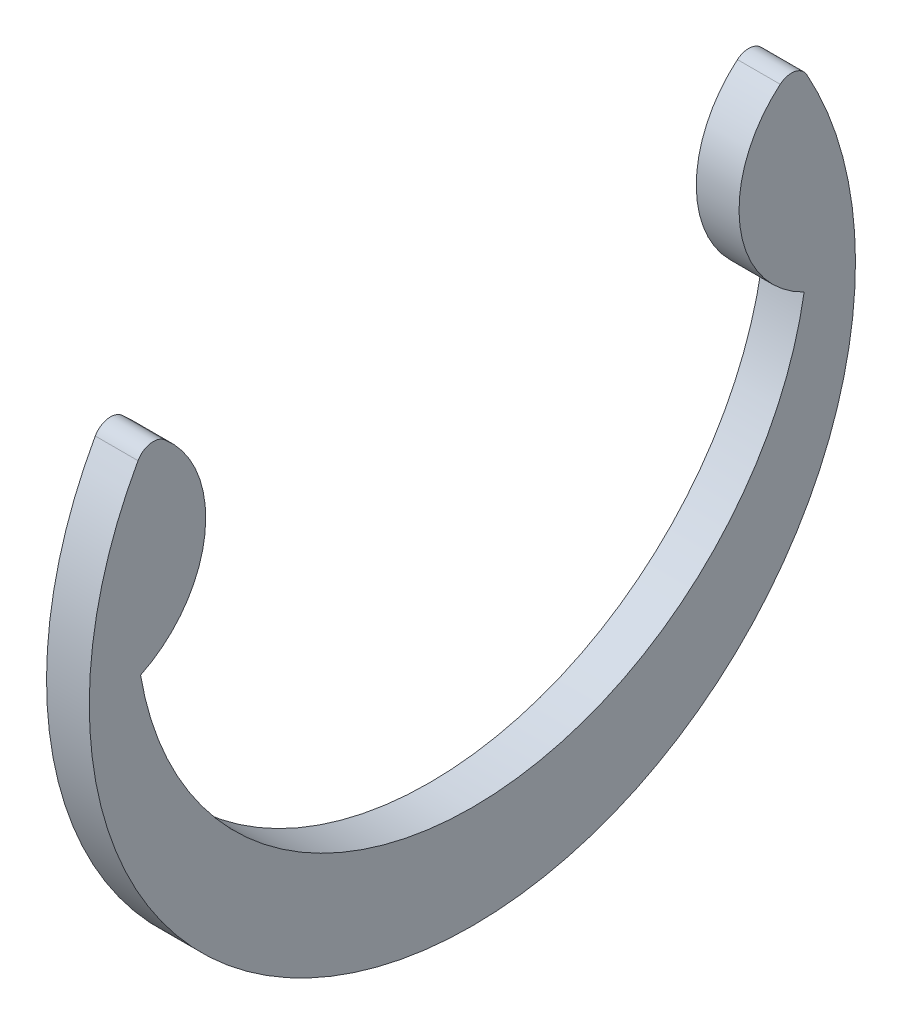
ISO-10303-21;
HEADER;
FILE_DESCRIPTION(('STEP AP214'),'2;1');
FILE_NAME('part.step','',(''),(''),'','','');
FILE_SCHEMA(('AUTOMOTIVE_DESIGN { 1 0 10303 214 1 1 1 1 }'));
ENDSEC;
DATA;
#1=APPLICATION_CONTEXT('core data for automotive mechanical design processes');
#2=APPLICATION_PROTOCOL_DEFINITION('international standard','automotive_design',2000,#1);
#3=PRODUCT_CONTEXT('',#1,'mechanical');
#4=PRODUCT('Part','Part','',(#3));
#5=PRODUCT_RELATED_PRODUCT_CATEGORY('part','',(#4));
#6=PRODUCT_DEFINITION_FORMATION('','',#4);
#7=PRODUCT_DEFINITION_CONTEXT('part definition',#1,'design');
#8=PRODUCT_DEFINITION('design','',#6,#7);
#9=PRODUCT_DEFINITION_SHAPE('','',#8);
#10=(LENGTH_UNIT() NAMED_UNIT(*) SI_UNIT(.MILLI.,.METRE.));
#11=(NAMED_UNIT(*) PLANE_ANGLE_UNIT() SI_UNIT($,.RADIAN.));
#12=(NAMED_UNIT(*) SI_UNIT($,.STERADIAN.) SOLID_ANGLE_UNIT());
#13=UNCERTAINTY_MEASURE_WITH_UNIT(LENGTH_MEASURE(1.E-05),#10,'distance_accuracy_value','');
#14=(GEOMETRIC_REPRESENTATION_CONTEXT(3) GLOBAL_UNCERTAINTY_ASSIGNED_CONTEXT((#13)) GLOBAL_UNIT_ASSIGNED_CONTEXT((#10,
#11,#12)) REPRESENTATION_CONTEXT('',''));
#15=CARTESIAN_POINT('',(0.,0.,0.));
#16=DIRECTION('',(0.,0.,1.));
#17=DIRECTION('',(1.,0.,0.));
#18=AXIS2_PLACEMENT_3D('',#15,#16,#17);
#19=CARTESIAN_POINT('',(0.3175,1.53954533421681,5.6690624111248));
#20=DIRECTION('',(-1.,0.,0.));
#21=DIRECTION('',(0.,0.,1.));
#22=AXIS2_PLACEMENT_3D('',#19,#20,#21);
#23=CYLINDRICAL_SURFACE('',#22,1.7087909009647);
#24=CARTESIAN_POINT('',(-0.3175,1.53954533421681,5.6690624111248));
#25=DIRECTION('',(1.,0.,0.));
#26=DIRECTION('',(0.,0.,1.));
#27=AXIS2_PLACEMENT_3D('',#24,#25,#26);
#28=CIRCLE('',#27,1.7087909009647);
#29=CARTESIAN_POINT('',(-0.3175,0.,4.9276));
#30=VERTEX_POINT('',#29);
#31=CARTESIAN_POINT('',(-0.3175,2.84950455432869,4.57180529227634));
#32=VERTEX_POINT('',#31);
#33=EDGE_CURVE('E118',#30,#32,#28,.T.);
#34=ORIENTED_EDGE('',*,*,#33,.T.);
#35=DIRECTION('',(-1.,0.,0.));
#36=VECTOR('',#35,1.);
#37=CARTESIAN_POINT('',(0.3175,2.84950455432869,4.57180529227634));
#38=LINE('',#37,#36);
#39=CARTESIAN_POINT('',(0.3175,2.84950455432869,4.57180529227634));
#40=VERTEX_POINT('',#39);
#41=EDGE_CURVE('E11',#40,#32,#38,.T.);
#42=ORIENTED_EDGE('',*,*,#41,.F.);
#43=CARTESIAN_POINT('',(0.3175,1.53954533421681,5.6690624111248));
#44=DIRECTION('',(1.,0.,0.));
#45=DIRECTION('',(0.,0.,1.));
#46=AXIS2_PLACEMENT_3D('',#43,#44,#45);
#47=CIRCLE('',#46,1.7087909009647);
#48=CARTESIAN_POINT('',(0.3175,0.,4.9276));
#49=VERTEX_POINT('',#48);
#50=EDGE_CURVE('E128',#49,#40,#47,.T.);
#51=ORIENTED_EDGE('',*,*,#50,.F.);
#52=DIRECTION('',(-1.,0.,0.));
#53=VECTOR('',#52,1.);
#54=CARTESIAN_POINT('',(0.3175,0.,4.9276));
#55=LINE('',#54,#53);
#56=EDGE_CURVE('E114',#49,#30,#55,.T.);
#57=ORIENTED_EDGE('',*,*,#56,.T.);
#58=EDGE_LOOP('',(#34,#42,#51,#57));
#59=FACE_BOUND('',#58,.T.);
#60=ADVANCED_FACE('F34',(#59),#23,.T.);
#61=CARTESIAN_POINT('',(0.3175,2.65011523069168,4.73881915913885));
#62=DIRECTION('',(-1.,0.,0.));
#63=DIRECTION('',(0.,0.,1.));
#64=AXIS2_PLACEMENT_3D('',#61,#62,#63);
#65=CYLINDRICAL_SURFACE('',#64,0.260095624924363);
#66=CARTESIAN_POINT('',(-0.3175,2.65011523069168,4.73881915913885));
#67=DIRECTION('',(1.,0.,0.));
#68=DIRECTION('',(0.,0.,1.));
#69=AXIS2_PLACEMENT_3D('',#66,#67,#68);
#70=CIRCLE('',#69,0.260095624924363);
#71=CARTESIAN_POINT('',(-0.3175,2.77706666666667,4.96582811713101));
#72=VERTEX_POINT('',#71);
#73=EDGE_CURVE('E121',#32,#72,#70,.T.);
#74=ORIENTED_EDGE('',*,*,#73,.T.);
#75=DIRECTION('',(-1.,0.,0.));
#76=VECTOR('',#75,1.);
#77=CARTESIAN_POINT('',(0.3175,2.77706666666667,4.96582811713101));
#78=LINE('',#77,#76);
#79=CARTESIAN_POINT('',(0.3175,2.77706666666667,4.96582811713101));
#80=VERTEX_POINT('',#79);
#81=EDGE_CURVE('E42',#80,#72,#78,.T.);
#82=ORIENTED_EDGE('',*,*,#81,.F.);
#83=CARTESIAN_POINT('',(0.3175,2.65011523069168,4.73881915913885));
#84=DIRECTION('',(1.,0.,0.));
#85=DIRECTION('',(0.,0.,1.));
#86=AXIS2_PLACEMENT_3D('',#83,#84,#85);
#87=CIRCLE('',#86,0.260095624924363);
#88=EDGE_CURVE('E87',#40,#80,#87,.T.);
#89=ORIENTED_EDGE('',*,*,#88,.F.);
#90=ORIENTED_EDGE('',*,*,#41,.T.);
#91=EDGE_LOOP('',(#74,#82,#89,#90));
#92=FACE_BOUND('',#91,.T.);
#93=ADVANCED_FACE('F152',(#92),#65,.T.);
#94=CARTESIAN_POINT('',(0.3175,0.,0.));
#95=DIRECTION('',(-1.,0.,0.));
#96=DIRECTION('',(0.,0.,1.));
#97=AXIS2_PLACEMENT_3D('',#94,#95,#96);
#98=CYLINDRICAL_SURFACE('',#97,5.6896);
#99=CARTESIAN_POINT('',(-0.3175,0.,0.));
#100=DIRECTION('',(1.,0.,0.));
#101=DIRECTION('',(0.,0.,1.));
#102=AXIS2_PLACEMENT_3D('',#99,#100,#101);
#103=CIRCLE('',#102,5.6896);
#104=CARTESIAN_POINT('',(-0.3175,2.77706666666667,-4.96582811713101));
#105=VERTEX_POINT('',#104);
#106=EDGE_CURVE('E123',#72,#105,#103,.T.);
#107=ORIENTED_EDGE('',*,*,#106,.T.);
#108=DIRECTION('',(-1.,0.,0.));
#109=VECTOR('',#108,1.);
#110=CARTESIAN_POINT('',(0.3175,2.77706666666667,-4.96582811713101));
#111=LINE('',#110,#109);
#112=CARTESIAN_POINT('',(0.3175,2.77706666666667,-4.96582811713101));
#113=VERTEX_POINT('',#112);
#114=EDGE_CURVE('E109',#113,#105,#111,.T.);
#115=ORIENTED_EDGE('',*,*,#114,.F.);
#116=CARTESIAN_POINT('',(0.3175,0.,0.));
#117=DIRECTION('',(1.,0.,0.));
#118=DIRECTION('',(0.,0.,1.));
#119=AXIS2_PLACEMENT_3D('',#116,#117,#118);
#120=CIRCLE('',#119,5.6896);
#121=EDGE_CURVE('E100',#80,#113,#120,.T.);
#122=ORIENTED_EDGE('',*,*,#121,.F.);
#123=ORIENTED_EDGE('',*,*,#81,.T.);
#124=EDGE_LOOP('',(#107,#115,#122,#123));
#125=FACE_BOUND('',#124,.T.);
#126=ADVANCED_FACE('F134',(#125),#98,.T.);
#127=CARTESIAN_POINT('',(0.3175,2.65011523069168,-4.73881915913885));
#128=DIRECTION('',(-1.,0.,0.));
#129=DIRECTION('',(0.,0.,1.));
#130=AXIS2_PLACEMENT_3D('',#127,#128,#129);
#131=CYLINDRICAL_SURFACE('',#130,0.260095624924363);
#132=CARTESIAN_POINT('',(-0.3175,2.65011523069168,-4.73881915913885));
#133=DIRECTION('',(1.,0.,0.));
#134=DIRECTION('',(0.,0.,-1.));
#135=AXIS2_PLACEMENT_3D('',#132,#133,#134);
#136=CIRCLE('',#135,0.260095624924363);
#137=CARTESIAN_POINT('',(-0.3175,2.84950455432869,-4.57180529227634));
#138=VERTEX_POINT('',#137);
#139=EDGE_CURVE('E108',#105,#138,#136,.T.);
#140=ORIENTED_EDGE('',*,*,#139,.T.);
#141=DIRECTION('',(-1.,0.,0.));
#142=VECTOR('',#141,1.);
#143=CARTESIAN_POINT('',(0.3175,2.84950455432869,-4.57180529227634));
#144=LINE('',#143,#142);
#145=CARTESIAN_POINT('',(0.3175,2.84950455432869,-4.57180529227634));
#146=VERTEX_POINT('',#145);
#147=EDGE_CURVE('E105',#146,#138,#144,.T.);
#148=ORIENTED_EDGE('',*,*,#147,.F.);
#149=CARTESIAN_POINT('',(0.3175,2.65011523069168,-4.73881915913885));
#150=DIRECTION('',(1.,0.,0.));
#151=DIRECTION('',(0.,0.,-1.));
#152=AXIS2_PLACEMENT_3D('',#149,#150,#151);
#153=CIRCLE('',#152,0.260095624924363);
#154=EDGE_CURVE('E94',#113,#146,#153,.T.);
#155=ORIENTED_EDGE('',*,*,#154,.F.);
#156=ORIENTED_EDGE('',*,*,#114,.T.);
#157=EDGE_LOOP('',(#140,#148,#155,#156));
#158=FACE_BOUND('',#157,.T.);
#159=ADVANCED_FACE('F106',(#158),#131,.T.);
#160=CARTESIAN_POINT('',(0.3175,1.53954533421681,-5.6690624111248));
#161=DIRECTION('',(-1.,0.,0.));
#162=DIRECTION('',(0.,0.,1.));
#163=AXIS2_PLACEMENT_3D('',#160,#161,#162);
#164=CYLINDRICAL_SURFACE('',#163,1.7087909009647);
#165=CARTESIAN_POINT('',(-0.3175,1.53954533421681,-5.6690624111248));
#166=DIRECTION('',(1.,0.,0.));
#167=DIRECTION('',(0.,0.,1.));
#168=AXIS2_PLACEMENT_3D('',#165,#166,#167);
#169=CIRCLE('',#168,1.7087909009647);
#170=CARTESIAN_POINT('',(-0.3175,0.,-4.9276));
#171=VERTEX_POINT('',#170);
#172=EDGE_CURVE('E73',#138,#171,#169,.T.);
#173=ORIENTED_EDGE('',*,*,#172,.T.);
#174=DIRECTION('',(-1.,0.,0.));
#175=VECTOR('',#174,1.);
#176=CARTESIAN_POINT('',(0.3175,0.,-4.9276));
#177=LINE('',#176,#175);
#178=CARTESIAN_POINT('',(0.3175,0.,-4.9276));
#179=VERTEX_POINT('',#178);
#180=EDGE_CURVE('E110',#179,#171,#177,.T.);
#181=ORIENTED_EDGE('',*,*,#180,.F.);
#182=CARTESIAN_POINT('',(0.3175,1.53954533421681,-5.6690624111248));
#183=DIRECTION('',(1.,0.,0.));
#184=DIRECTION('',(0.,0.,1.));
#185=AXIS2_PLACEMENT_3D('',#182,#183,#184);
#186=CIRCLE('',#185,1.7087909009647);
#187=EDGE_CURVE('E98',#146,#179,#186,.T.);
#188=ORIENTED_EDGE('',*,*,#187,.F.);
#189=ORIENTED_EDGE('',*,*,#147,.T.);
#190=EDGE_LOOP('',(#173,#181,#188,#189));
#191=FACE_BOUND('',#190,.T.);
#192=ADVANCED_FACE('F112',(#191),#164,.T.);
#193=CARTESIAN_POINT('',(0.3175,0.831695121951218,0.));
#194=DIRECTION('',(-1.,0.,0.));
#195=DIRECTION('',(0.,0.,1.));
#196=AXIS2_PLACEMENT_3D('',#193,#194,#195);
#197=CYLINDRICAL_SURFACE('',#196,4.99729512195122);
#198=CARTESIAN_POINT('',(-0.3175,0.831695121951218,0.));
#199=DIRECTION('',(-1.,0.,0.));
#200=DIRECTION('',(0.,0.,-1.));
#201=AXIS2_PLACEMENT_3D('',#198,#199,#200);
#202=CIRCLE('',#201,4.99729512195122);
#203=EDGE_CURVE('E79',#171,#30,#202,.T.);
#204=ORIENTED_EDGE('',*,*,#203,.T.);
#205=ORIENTED_EDGE('',*,*,#56,.F.);
#206=CARTESIAN_POINT('',(0.3175,0.831695121951218,0.));
#207=DIRECTION('',(-1.,0.,0.));
#208=DIRECTION('',(0.,0.,-1.));
#209=AXIS2_PLACEMENT_3D('',#206,#207,#208);
#210=CIRCLE('',#209,4.99729512195122);
#211=EDGE_CURVE('E50',#179,#49,#210,.T.);
#212=ORIENTED_EDGE('',*,*,#211,.F.);
#213=ORIENTED_EDGE('',*,*,#180,.T.);
#214=EDGE_LOOP('',(#204,#205,#212,#213));
#215=FACE_BOUND('',#214,.T.);
#216=ADVANCED_FACE('F141',(#215),#197,.F.);
#217=CARTESIAN_POINT('',(0.3175,1.18562022808401,2.8345312055624));
#218=DIRECTION('',(-1.,0.,0.));
#219=DIRECTION('',(0.,0.,1.));
#220=AXIS2_PLACEMENT_3D('',#217,#218,#219);
#221=PLANE('',#220);
#222=ORIENTED_EDGE('',*,*,#50,.T.);
#223=ORIENTED_EDGE('',*,*,#88,.T.);
#224=ORIENTED_EDGE('',*,*,#121,.T.);
#225=ORIENTED_EDGE('',*,*,#154,.T.);
#226=ORIENTED_EDGE('',*,*,#187,.T.);
#227=ORIENTED_EDGE('',*,*,#211,.T.);
#228=EDGE_LOOP('',(#222,#223,#224,#225,#226,#227));
#229=FACE_BOUND('',#228,.T.);
#230=ADVANCED_FACE('F96',(#229),#221,.F.);
#231=CARTESIAN_POINT('',(-0.3175,1.18562022808401,2.8345312055624));
#232=DIRECTION('',(-1.,0.,0.));
#233=DIRECTION('',(0.,0.,1.));
#234=AXIS2_PLACEMENT_3D('',#231,#232,#233);
#235=PLANE('',#234);
#236=ORIENTED_EDGE('',*,*,#33,.F.);
#237=ORIENTED_EDGE('',*,*,#203,.F.);
#238=ORIENTED_EDGE('',*,*,#172,.F.);
#239=ORIENTED_EDGE('',*,*,#139,.F.);
#240=ORIENTED_EDGE('',*,*,#106,.F.);
#241=ORIENTED_EDGE('',*,*,#73,.F.);
#242=EDGE_LOOP('',(#236,#237,#238,#239,#240,#241));
#243=FACE_BOUND('',#242,.T.);
#244=ADVANCED_FACE('F137',(#243),#235,.T.);
#245=CLOSED_SHELL('',(#60,#93,#126,#159,#192,#216,#230,#244));
#246=MANIFOLD_SOLID_BREP('B2',#245);
#247=ADVANCED_BREP_SHAPE_REPRESENTATION('',(#18,#246),#14);
#248=SHAPE_DEFINITION_REPRESENTATION(#9,#247);
ENDSEC;
END-ISO-10303-21;
